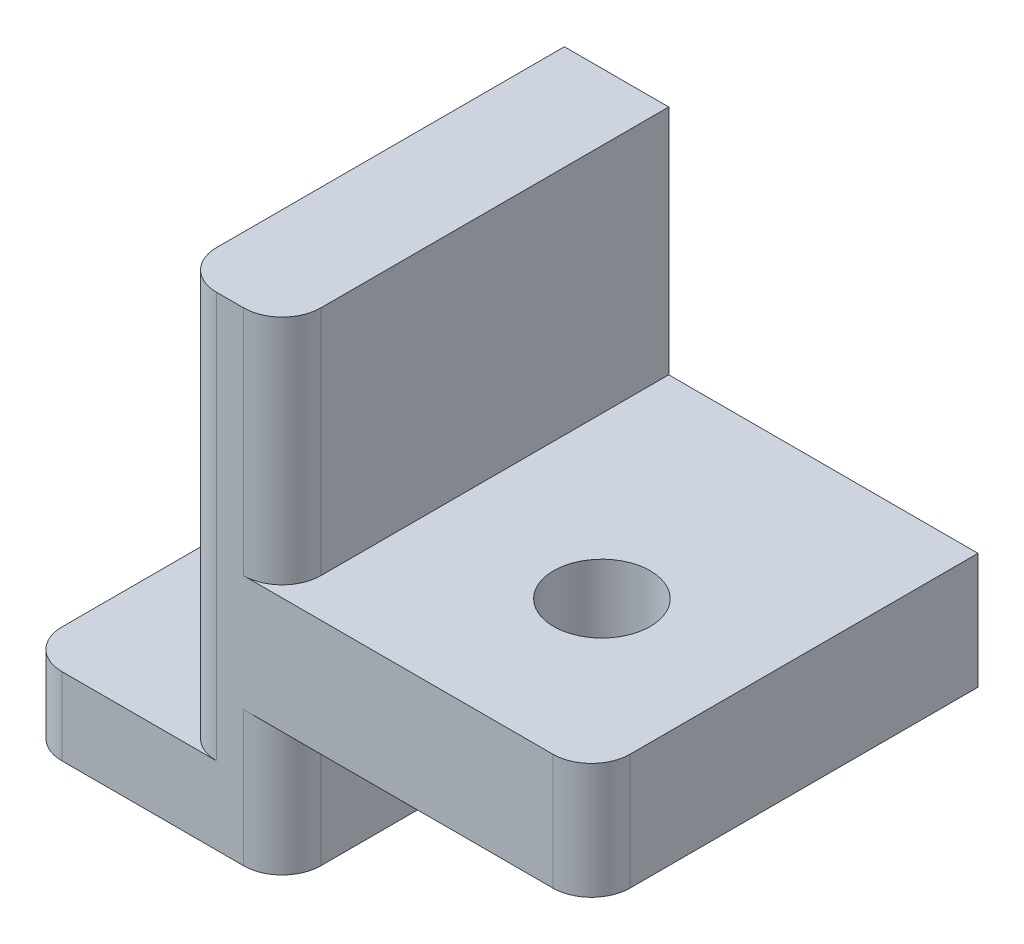
ISO-10303-21;
HEADER;
FILE_DESCRIPTION(('STEP AP214'),'2;1');
FILE_NAME('part.step','',(''),(''),'','','');
FILE_SCHEMA(('AUTOMOTIVE_DESIGN { 1 0 10303 214 1 1 1 1 }'));
ENDSEC;
DATA;
#1=APPLICATION_CONTEXT('core data for automotive mechanical design processes');
#2=APPLICATION_PROTOCOL_DEFINITION('international standard','automotive_design',2000,#1);
#3=PRODUCT_CONTEXT('',#1,'mechanical');
#4=PRODUCT('Part','Part','',(#3));
#5=PRODUCT_RELATED_PRODUCT_CATEGORY('part','',(#4));
#6=PRODUCT_DEFINITION_FORMATION('','',#4);
#7=PRODUCT_DEFINITION_CONTEXT('part definition',#1,'design');
#8=PRODUCT_DEFINITION('design','',#6,#7);
#9=PRODUCT_DEFINITION_SHAPE('','',#8);
#10=(LENGTH_UNIT() NAMED_UNIT(*) SI_UNIT(.MILLI.,.METRE.));
#11=(NAMED_UNIT(*) PLANE_ANGLE_UNIT() SI_UNIT($,.RADIAN.));
#12=(NAMED_UNIT(*) SI_UNIT($,.STERADIAN.) SOLID_ANGLE_UNIT());
#13=UNCERTAINTY_MEASURE_WITH_UNIT(LENGTH_MEASURE(1.E-05),#10,'distance_accuracy_value','');
#14=(GEOMETRIC_REPRESENTATION_CONTEXT(3) GLOBAL_UNCERTAINTY_ASSIGNED_CONTEXT((#13)) GLOBAL_UNIT_ASSIGNED_CONTEXT((#10,
#11,#12)) REPRESENTATION_CONTEXT('',''));
#15=CARTESIAN_POINT('',(0.,0.,0.));
#16=DIRECTION('',(0.,0.,1.));
#17=DIRECTION('',(1.,0.,0.));
#18=AXIS2_PLACEMENT_3D('',#15,#16,#17);
#19=CARTESIAN_POINT('',(-2.7,-4.5,10.));
#20=DIRECTION('',(1.,0.,0.));
#21=DIRECTION('',(0.,0.,-1.));
#22=AXIS2_PLACEMENT_3D('',#19,#20,#21);
#23=PLANE('',#22);
#24=DIRECTION('',(0.,0.,-1.));
#25=VECTOR('',#24,1.);
#26=CARTESIAN_POINT('',(-2.7,-4.5,10.));
#27=LINE('',#26,#25);
#28=CARTESIAN_POINT('',(-2.7,-4.5,9.));
#29=VERTEX_POINT('',#28);
#30=CARTESIAN_POINT('',(-2.7,-4.5,0.));
#31=VERTEX_POINT('',#30);
#32=EDGE_CURVE('E143',#29,#31,#27,.T.);
#33=ORIENTED_EDGE('',*,*,#32,.F.);
#34=DIRECTION('',(0.,-1.,0.));
#35=VECTOR('',#34,1.);
#36=CARTESIAN_POINT('',(-2.7,-4.5,9.));
#37=LINE('',#36,#35);
#38=CARTESIAN_POINT('',(-2.7,6.,9.));
#39=VERTEX_POINT('',#38);
#40=EDGE_CURVE('E55',#29,#39,#37,.F.);
#41=ORIENTED_EDGE('',*,*,#40,.T.);
#42=DIRECTION('',(0.,0.,-1.));
#43=VECTOR('',#42,1.);
#44=CARTESIAN_POINT('',(-2.7,6.,10.));
#45=LINE('',#44,#43);
#46=CARTESIAN_POINT('',(-2.7,6.,0.));
#47=VERTEX_POINT('',#46);
#48=EDGE_CURVE('E164',#39,#47,#45,.T.);
#49=ORIENTED_EDGE('',*,*,#48,.T.);
#50=DIRECTION('',(0.,-1.,0.));
#51=VECTOR('',#50,1.);
#52=CARTESIAN_POINT('',(-2.7,-4.5,0.));
#53=LINE('',#52,#51);
#54=EDGE_CURVE('E158',#47,#31,#53,.T.);
#55=ORIENTED_EDGE('',*,*,#54,.T.);
#56=EDGE_LOOP('',(#33,#41,#49,#55));
#57=FACE_BOUND('',#56,.T.);
#58=ADVANCED_FACE('F39',(#57),#23,.F.);
#59=CARTESIAN_POINT('',(-6.7,-4.5,10.));
#60=DIRECTION('',(0.,-1.,0.));
#61=DIRECTION('',(0.,0.,-1.));
#62=AXIS2_PLACEMENT_3D('',#59,#60,#61);
#63=PLANE('',#62);
#64=DIRECTION('',(0.,0.,-1.));
#65=VECTOR('',#64,1.);
#66=CARTESIAN_POINT('',(-6.7,-4.5,10.));
#67=LINE('',#66,#65);
#68=CARTESIAN_POINT('',(-6.7,-4.5,9.));
#69=VERTEX_POINT('',#68);
#70=CARTESIAN_POINT('',(-6.7,-4.5,0.));
#71=VERTEX_POINT('',#70);
#72=EDGE_CURVE('E152',#69,#71,#67,.T.);
#73=ORIENTED_EDGE('',*,*,#72,.F.);
#74=CARTESIAN_POINT('',(-5.7,-4.5,9.));
#75=DIRECTION('',(0.,-1.,0.));
#76=DIRECTION('',(0.,0.,-1.));
#77=AXIS2_PLACEMENT_3D('',#74,#75,#76);
#78=CIRCLE('',#77,1.);
#79=CARTESIAN_POINT('',(-5.7,-4.5,10.));
#80=VERTEX_POINT('',#79);
#81=EDGE_CURVE('E265',#69,#80,#78,.F.);
#82=ORIENTED_EDGE('',*,*,#81,.T.);
#83=DIRECTION('',(-1.,0.,0.));
#84=VECTOR('',#83,1.);
#85=CARTESIAN_POINT('',(-6.7,-4.5,10.));
#86=LINE('',#85,#84);
#87=CARTESIAN_POINT('',(-1.7,-4.5,10.));
#88=VERTEX_POINT('',#87);
#89=EDGE_CURVE('E206',#88,#80,#86,.T.);
#90=ORIENTED_EDGE('',*,*,#89,.F.);
#91=CARTESIAN_POINT('',(-1.7,-4.5,9.));
#92=DIRECTION('',(0.,-1.,0.));
#93=DIRECTION('',(0.,0.,-1.));
#94=AXIS2_PLACEMENT_3D('',#91,#92,#93);
#95=CIRCLE('',#94,1.);
#96=EDGE_CURVE('E11',#88,#29,#95,.T.);
#97=ORIENTED_EDGE('',*,*,#96,.T.);
#98=ORIENTED_EDGE('',*,*,#32,.T.);
#99=DIRECTION('',(-1.,0.,0.));
#100=VECTOR('',#99,1.);
#101=CARTESIAN_POINT('',(-6.7,-4.5,0.));
#102=LINE('',#101,#100);
#103=EDGE_CURVE('E147',#31,#71,#102,.T.);
#104=ORIENTED_EDGE('',*,*,#103,.T.);
#105=EDGE_LOOP('',(#73,#82,#90,#97,#98,#104));
#106=FACE_BOUND('',#105,.T.);
#107=ADVANCED_FACE('F146',(#106),#63,.F.);
#108=CARTESIAN_POINT('',(-6.7,-6.5,10.));
#109=DIRECTION('',(1.,0.,0.));
#110=DIRECTION('',(0.,0.,-1.));
#111=AXIS2_PLACEMENT_3D('',#108,#109,#110);
#112=PLANE('',#111);
#113=DIRECTION('',(0.,0.,-1.));
#114=VECTOR('',#113,1.);
#115=CARTESIAN_POINT('',(-6.7,-6.5,10.));
#116=LINE('',#115,#114);
#117=CARTESIAN_POINT('',(-6.7,-6.5,9.));
#118=VERTEX_POINT('',#117);
#119=CARTESIAN_POINT('',(-6.7,-6.5,0.));
#120=VERTEX_POINT('',#119);
#121=EDGE_CURVE('E227',#118,#120,#116,.T.);
#122=ORIENTED_EDGE('',*,*,#121,.F.);
#123=DIRECTION('',(0.,-1.,0.));
#124=VECTOR('',#123,1.);
#125=CARTESIAN_POINT('',(-6.7,-6.5,9.));
#126=LINE('',#125,#124);
#127=EDGE_CURVE('E262',#118,#69,#126,.F.);
#128=ORIENTED_EDGE('',*,*,#127,.T.);
#129=ORIENTED_EDGE('',*,*,#72,.T.);
#130=DIRECTION('',(0.,-1.,0.));
#131=VECTOR('',#130,1.);
#132=CARTESIAN_POINT('',(-6.7,-6.5,0.));
#133=LINE('',#132,#131);
#134=EDGE_CURVE('E161',#71,#120,#133,.T.);
#135=ORIENTED_EDGE('',*,*,#134,.T.);
#136=EDGE_LOOP('',(#122,#128,#129,#135));
#137=FACE_BOUND('',#136,.T.);
#138=ADVANCED_FACE('F315',(#137),#112,.F.);
#139=CARTESIAN_POINT('',(0.,-6.5,10.));
#140=DIRECTION('',(0.,1.,0.));
#141=DIRECTION('',(-1.,0.,0.));
#142=AXIS2_PLACEMENT_3D('',#139,#140,#141);
#143=PLANE('',#142);
#144=DIRECTION('',(1.,0.,0.));
#145=VECTOR('',#144,1.);
#146=CARTESIAN_POINT('',(0.,-6.5,10.));
#147=LINE('',#146,#145);
#148=CARTESIAN_POINT('',(-5.7,-6.5,10.));
#149=VERTEX_POINT('',#148);
#150=CARTESIAN_POINT('',(-1.,-6.5,10.));
#151=VERTEX_POINT('',#150);
#152=EDGE_CURVE('E370',#149,#151,#147,.T.);
#153=ORIENTED_EDGE('',*,*,#152,.F.);
#154=CARTESIAN_POINT('',(-5.7,-6.5,9.));
#155=DIRECTION('',(0.,1.,0.));
#156=DIRECTION('',(-1.,0.,0.));
#157=AXIS2_PLACEMENT_3D('',#154,#155,#156);
#158=CIRCLE('',#157,1.);
#159=EDGE_CURVE('E259',#149,#118,#158,.F.);
#160=ORIENTED_EDGE('',*,*,#159,.T.);
#161=ORIENTED_EDGE('',*,*,#121,.T.);
#162=DIRECTION('',(1.,0.,0.));
#163=VECTOR('',#162,1.);
#164=CARTESIAN_POINT('',(0.,-6.5,0.));
#165=LINE('',#164,#163);
#166=CARTESIAN_POINT('',(0.,-6.5,0.));
#167=VERTEX_POINT('',#166);
#168=EDGE_CURVE('E179',#120,#167,#165,.T.);
#169=ORIENTED_EDGE('',*,*,#168,.T.);
#170=DIRECTION('',(0.,0.,-1.));
#171=VECTOR('',#170,1.);
#172=CARTESIAN_POINT('',(0.,-6.5,10.));
#173=LINE('',#172,#171);
#174=CARTESIAN_POINT('',(0.,-6.5,9.));
#175=VERTEX_POINT('',#174);
#176=EDGE_CURVE('E224',#175,#167,#173,.T.);
#177=ORIENTED_EDGE('',*,*,#176,.F.);
#178=CARTESIAN_POINT('',(-1.,-6.5,9.));
#179=DIRECTION('',(0.,1.,0.));
#180=DIRECTION('',(-1.,0.,0.));
#181=AXIS2_PLACEMENT_3D('',#178,#179,#180);
#182=CIRCLE('',#181,1.);
#183=EDGE_CURVE('E256',#175,#151,#182,.F.);
#184=ORIENTED_EDGE('',*,*,#183,.T.);
#185=EDGE_LOOP('',(#153,#160,#161,#169,#177,#184));
#186=FACE_BOUND('',#185,.T.);
#187=ADVANCED_FACE('F362',(#186),#143,.F.);
#188=CARTESIAN_POINT('',(0.,-3.,10.));
#189=DIRECTION('',(-1.,0.,0.));
#190=DIRECTION('',(0.,-1.,0.));
#191=AXIS2_PLACEMENT_3D('',#188,#189,#190);
#192=PLANE('',#191);
#193=DIRECTION('',(0.,0.,-1.));
#194=VECTOR('',#193,1.);
#195=CARTESIAN_POINT('',(0.,-3.,10.));
#196=LINE('',#195,#194);
#197=CARTESIAN_POINT('',(0.,-3.,9.));
#198=VERTEX_POINT('',#197);
#199=CARTESIAN_POINT('',(0.,-3.,0.));
#200=VERTEX_POINT('',#199);
#201=EDGE_CURVE('E221',#198,#200,#196,.T.);
#202=ORIENTED_EDGE('',*,*,#201,.F.);
#203=DIRECTION('',(0.,1.,0.));
#204=VECTOR('',#203,1.);
#205=CARTESIAN_POINT('',(0.,-3.,9.));
#206=LINE('',#205,#204);
#207=EDGE_CURVE('E274',#198,#175,#206,.F.);
#208=ORIENTED_EDGE('',*,*,#207,.T.);
#209=ORIENTED_EDGE('',*,*,#176,.T.);
#210=DIRECTION('',(0.,1.,0.));
#211=VECTOR('',#210,1.);
#212=CARTESIAN_POINT('',(0.,-3.,0.));
#213=LINE('',#212,#211);
#214=EDGE_CURVE('E183',#167,#200,#213,.T.);
#215=ORIENTED_EDGE('',*,*,#214,.T.);
#216=EDGE_LOOP('',(#202,#208,#209,#215));
#217=FACE_BOUND('',#216,.T.);
#218=ADVANCED_FACE('F358',(#217),#192,.F.);
#219=CARTESIAN_POINT('',(8.,-3.,10.));
#220=DIRECTION('',(0.,1.,0.));
#221=DIRECTION('',(-1.,0.,0.));
#222=AXIS2_PLACEMENT_3D('',#219,#220,#221);
#223=PLANE('',#222);
#224=CARTESIAN_POINT('',(4.15,-3.,5.87954315170691));
#225=DIRECTION('',(0.,-1.,0.));
#226=DIRECTION('',(0.,0.,-1.));
#227=AXIS2_PLACEMENT_3D('',#224,#225,#226);
#228=CIRCLE('',#227,1.24999999999999);
#229=CARTESIAN_POINT('',(4.15,-3.,4.62954315170692));
#230=VERTEX_POINT('',#229);
#231=EDGE_CURVE('E171',#230,#230,#228,.T.);
#232=ORIENTED_EDGE('',*,*,#231,.F.);
#233=EDGE_LOOP('',(#232));
#234=FACE_BOUND('',#233,.T.);
#235=DIRECTION('',(0.,0.,-1.));
#236=VECTOR('',#235,1.);
#237=CARTESIAN_POINT('',(8.,-3.,10.));
#238=LINE('',#237,#236);
#239=CARTESIAN_POINT('',(8.,-3.,9.));
#240=VERTEX_POINT('',#239);
#241=CARTESIAN_POINT('',(8.,-3.,0.));
#242=VERTEX_POINT('',#241);
#243=EDGE_CURVE('E218',#240,#242,#238,.T.);
#244=ORIENTED_EDGE('',*,*,#243,.F.);
#245=CARTESIAN_POINT('',(7.,-3.,9.));
#246=DIRECTION('',(0.,1.,0.));
#247=DIRECTION('',(-1.,0.,0.));
#248=AXIS2_PLACEMENT_3D('',#245,#246,#247);
#249=CIRCLE('',#248,1.);
#250=CARTESIAN_POINT('',(7.,-3.,10.));
#251=VERTEX_POINT('',#250);
#252=EDGE_CURVE('E253',#240,#251,#249,.F.);
#253=ORIENTED_EDGE('',*,*,#252,.T.);
#254=DIRECTION('',(1.,0.,0.));
#255=VECTOR('',#254,1.);
#256=CARTESIAN_POINT('',(8.,-3.,10.));
#257=LINE('',#256,#255);
#258=CARTESIAN_POINT('',(-1.,-3.,10.));
#259=VERTEX_POINT('',#258);
#260=EDGE_CURVE('E373',#259,#251,#257,.T.);
#261=ORIENTED_EDGE('',*,*,#260,.F.);
#262=CARTESIAN_POINT('',(-1.,-3.,9.));
#263=DIRECTION('',(0.,1.,0.));
#264=DIRECTION('',(-1.,0.,0.));
#265=AXIS2_PLACEMENT_3D('',#262,#263,#264);
#266=CIRCLE('',#265,1.);
#267=EDGE_CURVE('E281',#259,#198,#266,.T.);
#268=ORIENTED_EDGE('',*,*,#267,.T.);
#269=ORIENTED_EDGE('',*,*,#201,.T.);
#270=DIRECTION('',(1.,0.,0.));
#271=VECTOR('',#270,1.);
#272=CARTESIAN_POINT('',(8.,-3.,0.));
#273=LINE('',#272,#271);
#274=EDGE_CURVE('E187',#200,#242,#273,.T.);
#275=ORIENTED_EDGE('',*,*,#274,.T.);
#276=EDGE_LOOP('',(#244,#253,#261,#268,#269,#275));
#277=FACE_BOUND('',#276,.T.);
#278=ADVANCED_FACE('F353',(#234,#277),#223,.F.);
#279=CARTESIAN_POINT('',(8.,0.,10.));
#280=DIRECTION('',(-1.,0.,0.));
#281=DIRECTION('',(0.,0.,1.));
#282=AXIS2_PLACEMENT_3D('',#279,#280,#281);
#283=PLANE('',#282);
#284=DIRECTION('',(0.,0.,-1.));
#285=VECTOR('',#284,1.);
#286=CARTESIAN_POINT('',(8.,0.,10.));
#287=LINE('',#286,#285);
#288=CARTESIAN_POINT('',(8.,0.,9.));
#289=VERTEX_POINT('',#288);
#290=CARTESIAN_POINT('',(8.,0.,0.));
#291=VERTEX_POINT('',#290);
#292=EDGE_CURVE('E215',#289,#291,#287,.T.);
#293=ORIENTED_EDGE('',*,*,#292,.F.);
#294=DIRECTION('',(0.,1.,0.));
#295=VECTOR('',#294,1.);
#296=CARTESIAN_POINT('',(8.,0.,9.));
#297=LINE('',#296,#295);
#298=EDGE_CURVE('E250',#289,#240,#297,.F.);
#299=ORIENTED_EDGE('',*,*,#298,.T.);
#300=ORIENTED_EDGE('',*,*,#243,.T.);
#301=DIRECTION('',(0.,1.,0.));
#302=VECTOR('',#301,1.);
#303=CARTESIAN_POINT('',(8.,0.,0.));
#304=LINE('',#303,#302);
#305=EDGE_CURVE('E191',#242,#291,#304,.T.);
#306=ORIENTED_EDGE('',*,*,#305,.T.);
#307=EDGE_LOOP('',(#293,#299,#300,#306));
#308=FACE_BOUND('',#307,.T.);
#309=ADVANCED_FACE('F348',(#308),#283,.F.);
#310=CARTESIAN_POINT('',(0.,0.,10.));
#311=DIRECTION('',(0.,-1.,0.));
#312=DIRECTION('',(0.,0.,-1.));
#313=AXIS2_PLACEMENT_3D('',#310,#311,#312);
#314=PLANE('',#313);
#315=CARTESIAN_POINT('',(4.15,0.,5.87954315170691));
#316=DIRECTION('',(0.,-1.,0.));
#317=DIRECTION('',(0.,0.,-1.));
#318=AXIS2_PLACEMENT_3D('',#315,#316,#317);
#319=CIRCLE('',#318,1.24999999999999);
#320=CARTESIAN_POINT('',(4.15,0.,4.62954315170692));
#321=VERTEX_POINT('',#320);
#322=EDGE_CURVE('E167',#321,#321,#319,.T.);
#323=ORIENTED_EDGE('',*,*,#322,.T.);
#324=EDGE_LOOP('',(#323));
#325=FACE_BOUND('',#324,.T.);
#326=DIRECTION('',(-1.,0.,0.));
#327=VECTOR('',#326,1.);
#328=CARTESIAN_POINT('',(0.,0.,10.));
#329=LINE('',#328,#327);
#330=CARTESIAN_POINT('',(7.,0.,10.));
#331=VERTEX_POINT('',#330);
#332=CARTESIAN_POINT('',(-1.,0.,10.));
#333=VERTEX_POINT('',#332);
#334=EDGE_CURVE('E302',#331,#333,#329,.T.);
#335=ORIENTED_EDGE('',*,*,#334,.F.);
#336=CARTESIAN_POINT('',(7.,0.,9.));
#337=DIRECTION('',(0.,-1.,0.));
#338=DIRECTION('',(0.,0.,-1.));
#339=AXIS2_PLACEMENT_3D('',#336,#337,#338);
#340=CIRCLE('',#339,1.);
#341=EDGE_CURVE('E247',#331,#289,#340,.F.);
#342=ORIENTED_EDGE('',*,*,#341,.T.);
#343=ORIENTED_EDGE('',*,*,#292,.T.);
#344=DIRECTION('',(-1.,0.,0.));
#345=VECTOR('',#344,1.);
#346=CARTESIAN_POINT('',(0.,0.,0.));
#347=LINE('',#346,#345);
#348=CARTESIAN_POINT('',(0.,0.,0.));
#349=VERTEX_POINT('',#348);
#350=EDGE_CURVE('E195',#291,#349,#347,.T.);
#351=ORIENTED_EDGE('',*,*,#350,.T.);
#352=DIRECTION('',(0.,0.,-1.));
#353=VECTOR('',#352,1.);
#354=CARTESIAN_POINT('',(0.,0.,10.));
#355=LINE('',#354,#353);
#356=CARTESIAN_POINT('',(0.,0.,9.));
#357=VERTEX_POINT('',#356);
#358=EDGE_CURVE('E212',#357,#349,#355,.T.);
#359=ORIENTED_EDGE('',*,*,#358,.F.);
#360=CARTESIAN_POINT('',(-1.,0.,9.));
#361=DIRECTION('',(0.,-1.,0.));
#362=DIRECTION('',(0.,0.,-1.));
#363=AXIS2_PLACEMENT_3D('',#360,#361,#362);
#364=CIRCLE('',#363,1.);
#365=EDGE_CURVE('E277',#357,#333,#364,.T.);
#366=ORIENTED_EDGE('',*,*,#365,.T.);
#367=EDGE_LOOP('',(#335,#342,#343,#351,#359,#366));
#368=FACE_BOUND('',#367,.T.);
#369=ADVANCED_FACE('F337',(#325,#368),#314,.F.);
#370=CARTESIAN_POINT('',(0.,6.,10.));
#371=DIRECTION('',(-1.,0.,0.));
#372=DIRECTION('',(0.,-1.,0.));
#373=AXIS2_PLACEMENT_3D('',#370,#371,#372);
#374=PLANE('',#373);
#375=DIRECTION('',(0.,0.,-1.));
#376=VECTOR('',#375,1.);
#377=CARTESIAN_POINT('',(0.,6.,10.));
#378=LINE('',#377,#376);
#379=CARTESIAN_POINT('',(0.,6.,9.));
#380=VERTEX_POINT('',#379);
#381=CARTESIAN_POINT('',(0.,6.,0.));
#382=VERTEX_POINT('',#381);
#383=EDGE_CURVE('E209',#380,#382,#378,.T.);
#384=ORIENTED_EDGE('',*,*,#383,.F.);
#385=DIRECTION('',(0.,1.,0.));
#386=VECTOR('',#385,1.);
#387=CARTESIAN_POINT('',(0.,6.,9.));
#388=LINE('',#387,#386);
#389=EDGE_CURVE('E271',#380,#357,#388,.F.);
#390=ORIENTED_EDGE('',*,*,#389,.T.);
#391=ORIENTED_EDGE('',*,*,#358,.T.);
#392=DIRECTION('',(0.,1.,0.));
#393=VECTOR('',#392,1.);
#394=CARTESIAN_POINT('',(0.,6.,0.));
#395=LINE('',#394,#393);
#396=EDGE_CURVE('E199',#349,#382,#395,.T.);
#397=ORIENTED_EDGE('',*,*,#396,.T.);
#398=EDGE_LOOP('',(#384,#390,#391,#397));
#399=FACE_BOUND('',#398,.T.);
#400=ADVANCED_FACE('F342',(#399),#374,.F.);
#401=CARTESIAN_POINT('',(-2.7,6.,10.));
#402=DIRECTION('',(0.,-1.,0.));
#403=DIRECTION('',(0.,0.,-1.));
#404=AXIS2_PLACEMENT_3D('',#401,#402,#403);
#405=PLANE('',#404);
#406=ORIENTED_EDGE('',*,*,#48,.F.);
#407=CARTESIAN_POINT('',(-1.7,6.,9.));
#408=DIRECTION('',(0.,-1.,0.));
#409=DIRECTION('',(0.,0.,-1.));
#410=AXIS2_PLACEMENT_3D('',#407,#408,#409);
#411=CIRCLE('',#410,1.);
#412=CARTESIAN_POINT('',(-1.7,6.,10.));
#413=VERTEX_POINT('',#412);
#414=EDGE_CURVE('E48',#39,#413,#411,.F.);
#415=ORIENTED_EDGE('',*,*,#414,.T.);
#416=DIRECTION('',(-1.,0.,0.));
#417=VECTOR('',#416,1.);
#418=CARTESIAN_POINT('',(-2.7,6.,10.));
#419=LINE('',#418,#417);
#420=CARTESIAN_POINT('',(-1.,6.,10.));
#421=VERTEX_POINT('',#420);
#422=EDGE_CURVE('E174',#421,#413,#419,.T.);
#423=ORIENTED_EDGE('',*,*,#422,.F.);
#424=CARTESIAN_POINT('',(-1.,6.,9.));
#425=DIRECTION('',(0.,-1.,0.));
#426=DIRECTION('',(0.,0.,-1.));
#427=AXIS2_PLACEMENT_3D('',#424,#425,#426);
#428=CIRCLE('',#427,1.);
#429=EDGE_CURVE('E268',#421,#380,#428,.F.);
#430=ORIENTED_EDGE('',*,*,#429,.T.);
#431=ORIENTED_EDGE('',*,*,#383,.T.);
#432=DIRECTION('',(-1.,0.,0.));
#433=VECTOR('',#432,1.);
#434=CARTESIAN_POINT('',(-2.7,6.,0.));
#435=LINE('',#434,#433);
#436=EDGE_CURVE('E203',#382,#47,#435,.T.);
#437=ORIENTED_EDGE('',*,*,#436,.T.);
#438=EDGE_LOOP('',(#406,#415,#423,#430,#431,#437));
#439=FACE_BOUND('',#438,.T.);
#440=ADVANCED_FACE('F294',(#439),#405,.F.);
#441=CARTESIAN_POINT('',(0.,0.,10.));
#442=DIRECTION('',(0.,0.,-1.));
#443=DIRECTION('',(-1.,0.,0.));
#444=AXIS2_PLACEMENT_3D('',#441,#442,#443);
#445=PLANE('',#444);
#446=ORIENTED_EDGE('',*,*,#422,.T.);
#447=DIRECTION('',(0.,-1.,0.));
#448=VECTOR('',#447,1.);
#449=CARTESIAN_POINT('',(-1.7,0.,10.));
#450=LINE('',#449,#448);
#451=EDGE_CURVE('E284',#413,#88,#450,.T.);
#452=ORIENTED_EDGE('',*,*,#451,.T.);
#453=ORIENTED_EDGE('',*,*,#89,.T.);
#454=DIRECTION('',(0.,-1.,0.));
#455=VECTOR('',#454,1.);
#456=CARTESIAN_POINT('',(-5.7,0.,10.));
#457=LINE('',#456,#455);
#458=EDGE_CURVE('E239',#80,#149,#457,.T.);
#459=ORIENTED_EDGE('',*,*,#458,.T.);
#460=ORIENTED_EDGE('',*,*,#152,.T.);
#461=DIRECTION('',(0.,1.,0.));
#462=VECTOR('',#461,1.);
#463=CARTESIAN_POINT('',(-1.,0.,10.));
#464=LINE('',#463,#462);
#465=EDGE_CURVE('E151',#151,#259,#464,.T.);
#466=ORIENTED_EDGE('',*,*,#465,.T.);
#467=ORIENTED_EDGE('',*,*,#260,.T.);
#468=DIRECTION('',(0.,1.,0.));
#469=VECTOR('',#468,1.);
#470=CARTESIAN_POINT('',(7.,0.,10.));
#471=LINE('',#470,#469);
#472=EDGE_CURVE('E243',#251,#331,#471,.T.);
#473=ORIENTED_EDGE('',*,*,#472,.T.);
#474=ORIENTED_EDGE('',*,*,#334,.T.);
#475=DIRECTION('',(0.,1.,0.));
#476=VECTOR('',#475,1.);
#477=CARTESIAN_POINT('',(-1.,0.,10.));
#478=LINE('',#477,#476);
#479=EDGE_CURVE('E235',#333,#421,#478,.T.);
#480=ORIENTED_EDGE('',*,*,#479,.T.);
#481=EDGE_LOOP('',(#446,#452,#453,#459,#460,#466,#467,#473,#474,#480));
#482=FACE_BOUND('',#481,.T.);
#483=ADVANCED_FACE('F298',(#482),#445,.F.);
#484=CARTESIAN_POINT('',(0.,0.,0.));
#485=DIRECTION('',(0.,0.,-1.));
#486=DIRECTION('',(-1.,0.,0.));
#487=AXIS2_PLACEMENT_3D('',#484,#485,#486);
#488=PLANE('',#487);
#489=ORIENTED_EDGE('',*,*,#54,.F.);
#490=ORIENTED_EDGE('',*,*,#436,.F.);
#491=ORIENTED_EDGE('',*,*,#396,.F.);
#492=ORIENTED_EDGE('',*,*,#350,.F.);
#493=ORIENTED_EDGE('',*,*,#305,.F.);
#494=ORIENTED_EDGE('',*,*,#274,.F.);
#495=ORIENTED_EDGE('',*,*,#214,.F.);
#496=ORIENTED_EDGE('',*,*,#168,.F.);
#497=ORIENTED_EDGE('',*,*,#134,.F.);
#498=ORIENTED_EDGE('',*,*,#103,.F.);
#499=EDGE_LOOP('',(#489,#490,#491,#492,#493,#494,#495,#496,#497,#498));
#500=FACE_BOUND('',#499,.T.);
#501=ADVANCED_FACE('F156',(#500),#488,.T.);
#502=CARTESIAN_POINT('',(4.15,-3.,5.87954315170691));
#503=DIRECTION('',(0.,-1.,0.));
#504=DIRECTION('',(0.,0.,-1.));
#505=AXIS2_PLACEMENT_3D('',#502,#503,#504);
#506=CYLINDRICAL_SURFACE('',#505,1.24999999999999);
#507=ORIENTED_EDGE('',*,*,#231,.T.);
#508=EDGE_LOOP('',(#507));
#509=FACE_BOUND('',#508,.T.);
#510=ORIENTED_EDGE('',*,*,#322,.F.);
#511=EDGE_LOOP('',(#510));
#512=FACE_BOUND('',#511,.T.);
#513=ADVANCED_FACE('F323',(#509,#512),#506,.F.);
#514=CARTESIAN_POINT('',(7.,0.,9.));
#515=DIRECTION('',(0.,1.,0.));
#516=DIRECTION('',(0.,0.,1.));
#517=AXIS2_PLACEMENT_3D('',#514,#515,#516);
#518=CYLINDRICAL_SURFACE('',#517,1.);
#519=ORIENTED_EDGE('',*,*,#252,.F.);
#520=ORIENTED_EDGE('',*,*,#298,.F.);
#521=ORIENTED_EDGE('',*,*,#341,.F.);
#522=ORIENTED_EDGE('',*,*,#472,.F.);
#523=EDGE_LOOP('',(#519,#520,#521,#522));
#524=FACE_BOUND('',#523,.T.);
#525=ADVANCED_FACE('F319',(#524),#518,.T.);
#526=CARTESIAN_POINT('',(-5.7,0.,9.));
#527=DIRECTION('',(0.,-1.,0.));
#528=DIRECTION('',(0.,0.,-1.));
#529=AXIS2_PLACEMENT_3D('',#526,#527,#528);
#530=CYLINDRICAL_SURFACE('',#529,1.);
#531=ORIENTED_EDGE('',*,*,#81,.F.);
#532=ORIENTED_EDGE('',*,*,#127,.F.);
#533=ORIENTED_EDGE('',*,*,#159,.F.);
#534=ORIENTED_EDGE('',*,*,#458,.F.);
#535=EDGE_LOOP('',(#531,#532,#533,#534));
#536=FACE_BOUND('',#535,.T.);
#537=ADVANCED_FACE('F322',(#536),#530,.T.);
#538=CARTESIAN_POINT('',(-1.,0.,9.));
#539=DIRECTION('',(0.,1.,0.));
#540=DIRECTION('',(-1.,0.,0.));
#541=AXIS2_PLACEMENT_3D('',#538,#539,#540);
#542=CYLINDRICAL_SURFACE('',#541,1.);
#543=ORIENTED_EDGE('',*,*,#365,.F.);
#544=ORIENTED_EDGE('',*,*,#389,.F.);
#545=ORIENTED_EDGE('',*,*,#429,.F.);
#546=ORIENTED_EDGE('',*,*,#479,.F.);
#547=EDGE_LOOP('',(#543,#544,#545,#546));
#548=FACE_BOUND('',#547,.T.);
#549=ADVANCED_FACE('F308',(#548),#542,.T.);
#550=CARTESIAN_POINT('',(-1.,0.,9.));
#551=DIRECTION('',(0.,1.,0.));
#552=DIRECTION('',(-1.,0.,0.));
#553=AXIS2_PLACEMENT_3D('',#550,#551,#552);
#554=CYLINDRICAL_SURFACE('',#553,1.);
#555=ORIENTED_EDGE('',*,*,#183,.F.);
#556=ORIENTED_EDGE('',*,*,#207,.F.);
#557=ORIENTED_EDGE('',*,*,#267,.F.);
#558=ORIENTED_EDGE('',*,*,#465,.F.);
#559=EDGE_LOOP('',(#555,#556,#557,#558));
#560=FACE_BOUND('',#559,.T.);
#561=ADVANCED_FACE('F304',(#560),#554,.T.);
#562=CARTESIAN_POINT('',(-1.7,0.,9.));
#563=DIRECTION('',(0.,-1.,0.));
#564=DIRECTION('',(0.,0.,-1.));
#565=AXIS2_PLACEMENT_3D('',#562,#563,#564);
#566=CYLINDRICAL_SURFACE('',#565,1.);
#567=ORIENTED_EDGE('',*,*,#414,.F.);
#568=ORIENTED_EDGE('',*,*,#40,.F.);
#569=ORIENTED_EDGE('',*,*,#96,.F.);
#570=ORIENTED_EDGE('',*,*,#451,.F.);
#571=EDGE_LOOP('',(#567,#568,#569,#570));
#572=FACE_BOUND('',#571,.T.);
#573=ADVANCED_FACE('F41',(#572),#566,.T.);
#574=CLOSED_SHELL('',(#58,#107,#138,#187,#218,#278,#309,#369,#400,#440,#483,#501,#513,#525,#537,
#549,#561,#573));
#575=MANIFOLD_SOLID_BREP('B2',#574);
#576=ADVANCED_BREP_SHAPE_REPRESENTATION('',(#18,#575),#14);
#577=SHAPE_DEFINITION_REPRESENTATION(#9,#576);
ENDSEC;
END-ISO-10303-21;
